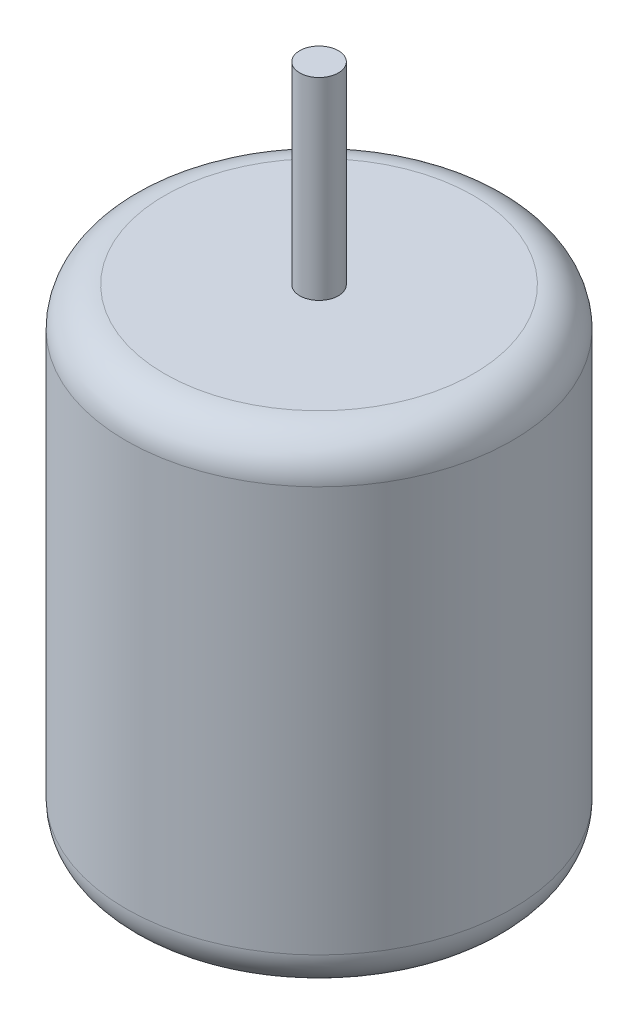
ISO-10303-21;
HEADER;
FILE_DESCRIPTION(('STEP AP214'),'2;1');
FILE_NAME('part.step','',(''),(''),'','','');
FILE_SCHEMA(('AUTOMOTIVE_DESIGN { 1 0 10303 214 1 1 1 1 }'));
ENDSEC;
DATA;
#1=APPLICATION_CONTEXT('core data for automotive mechanical design processes');
#2=APPLICATION_PROTOCOL_DEFINITION('international standard','automotive_design',2000,#1);
#3=PRODUCT_CONTEXT('',#1,'mechanical');
#4=PRODUCT('Part','Part','',(#3));
#5=PRODUCT_RELATED_PRODUCT_CATEGORY('part','',(#4));
#6=PRODUCT_DEFINITION_FORMATION('','',#4);
#7=PRODUCT_DEFINITION_CONTEXT('part definition',#1,'design');
#8=PRODUCT_DEFINITION('design','',#6,#7);
#9=PRODUCT_DEFINITION_SHAPE('','',#8);
#10=(LENGTH_UNIT() NAMED_UNIT(*) SI_UNIT(.MILLI.,.METRE.));
#11=(NAMED_UNIT(*) PLANE_ANGLE_UNIT() SI_UNIT($,.RADIAN.));
#12=(NAMED_UNIT(*) SI_UNIT($,.STERADIAN.) SOLID_ANGLE_UNIT());
#13=UNCERTAINTY_MEASURE_WITH_UNIT(LENGTH_MEASURE(1.E-05),#10,'distance_accuracy_value','');
#14=(GEOMETRIC_REPRESENTATION_CONTEXT(3) GLOBAL_UNCERTAINTY_ASSIGNED_CONTEXT((#13)) GLOBAL_UNIT_ASSIGNED_CONTEXT((#10,
#11,#12)) REPRESENTATION_CONTEXT('',''));
#15=CARTESIAN_POINT('',(0.,0.,0.));
#16=DIRECTION('',(0.,0.,1.));
#17=DIRECTION('',(1.,0.,0.));
#18=AXIS2_PLACEMENT_3D('',#15,#16,#17);
#19=CARTESIAN_POINT('',(0.,25.,0.));
#20=DIRECTION('',(0.,-1.,0.));
#21=DIRECTION('',(0.,0.,-1.));
#22=AXIS2_PLACEMENT_3D('',#19,#20,#21);
#23=CYLINDRICAL_SURFACE('',#22,10.);
#24=CARTESIAN_POINT('',(0.,2.,0.));
#25=DIRECTION('',(0.,1.,0.));
#26=DIRECTION('',(0.,0.,1.));
#27=AXIS2_PLACEMENT_3D('',#24,#25,#26);
#28=CIRCLE('',#27,10.);
#29=CARTESIAN_POINT('',(0.,2.,10.));
#30=VERTEX_POINT('',#29);
#31=EDGE_CURVE('E50',#30,#30,#28,.T.);
#32=ORIENTED_EDGE('',*,*,#31,.T.);
#33=EDGE_LOOP('',(#32));
#34=FACE_BOUND('',#33,.T.);
#35=CARTESIAN_POINT('',(0.,23.,0.));
#36=DIRECTION('',(0.,1.,0.));
#37=DIRECTION('',(0.,0.,1.));
#38=AXIS2_PLACEMENT_3D('',#35,#36,#37);
#39=CIRCLE('',#38,10.);
#40=CARTESIAN_POINT('',(0.,23.,10.));
#41=VERTEX_POINT('',#40);
#42=EDGE_CURVE('E55',#41,#41,#39,.F.);
#43=ORIENTED_EDGE('',*,*,#42,.T.);
#44=EDGE_LOOP('',(#43));
#45=FACE_BOUND('',#44,.T.);
#46=ADVANCED_FACE('F37',(#34,#45),#23,.T.);
#47=CARTESIAN_POINT('',(0.,25.,0.));
#48=DIRECTION('',(0.,1.,0.));
#49=DIRECTION('',(0.,0.,1.));
#50=AXIS2_PLACEMENT_3D('',#47,#48,#49);
#51=PLANE('',#50);
#52=CARTESIAN_POINT('',(0.,25.,0.));
#53=DIRECTION('',(0.,1.,0.));
#54=DIRECTION('',(0.,0.,1.));
#55=AXIS2_PLACEMENT_3D('',#52,#53,#54);
#56=CIRCLE('',#55,8.);
#57=CARTESIAN_POINT('',(0.,25.,8.));
#58=VERTEX_POINT('',#57);
#59=EDGE_CURVE('E10',#58,#58,#56,.T.);
#60=ORIENTED_EDGE('',*,*,#59,.T.);
#61=EDGE_LOOP('',(#60));
#62=FACE_BOUND('',#61,.T.);
#63=CARTESIAN_POINT('',(0.,25.,0.));
#64=DIRECTION('',(0.,1.,0.));
#65=DIRECTION('',(0.,0.,1.));
#66=AXIS2_PLACEMENT_3D('',#63,#64,#65);
#67=CIRCLE('',#66,1.);
#68=CARTESIAN_POINT('',(0.,25.,1.));
#69=VERTEX_POINT('',#68);
#70=EDGE_CURVE('E62',#69,#69,#67,.T.);
#71=ORIENTED_EDGE('',*,*,#70,.F.);
#72=EDGE_LOOP('',(#71));
#73=FACE_BOUND('',#72,.T.);
#74=ADVANCED_FACE('F79',(#62,#73),#51,.T.);
#75=CARTESIAN_POINT('',(0.,0.,0.));
#76=DIRECTION('',(0.,1.,0.));
#77=DIRECTION('',(0.,0.,1.));
#78=AXIS2_PLACEMENT_3D('',#75,#76,#77);
#79=PLANE('',#78);
#80=CARTESIAN_POINT('',(0.,0.,0.));
#81=DIRECTION('',(0.,1.,0.));
#82=DIRECTION('',(0.,0.,1.));
#83=AXIS2_PLACEMENT_3D('',#80,#81,#82);
#84=CIRCLE('',#83,8.);
#85=CARTESIAN_POINT('',(0.,0.,8.));
#86=VERTEX_POINT('',#85);
#87=EDGE_CURVE('E45',#86,#86,#84,.F.);
#88=ORIENTED_EDGE('',*,*,#87,.T.);
#89=EDGE_LOOP('',(#88));
#90=FACE_BOUND('',#89,.T.);
#91=ADVANCED_FACE('F75',(#90),#79,.F.);
#92=CARTESIAN_POINT('',(0.,35.,0.));
#93=DIRECTION('',(0.,-1.,0.));
#94=DIRECTION('',(0.,0.,-1.));
#95=AXIS2_PLACEMENT_3D('',#92,#93,#94);
#96=CYLINDRICAL_SURFACE('',#95,1.);
#97=CARTESIAN_POINT('',(0.,35.,0.));
#98=DIRECTION('',(0.,1.,0.));
#99=DIRECTION('',(0.,0.,1.));
#100=AXIS2_PLACEMENT_3D('',#97,#98,#99);
#101=CIRCLE('',#100,1.);
#102=CARTESIAN_POINT('',(0.,35.,1.));
#103=VERTEX_POINT('',#102);
#104=EDGE_CURVE('E61',#103,#103,#101,.T.);
#105=ORIENTED_EDGE('',*,*,#104,.F.);
#106=EDGE_LOOP('',(#105));
#107=FACE_BOUND('',#106,.T.);
#108=ORIENTED_EDGE('',*,*,#70,.T.);
#109=EDGE_LOOP('',(#108));
#110=FACE_BOUND('',#109,.T.);
#111=ADVANCED_FACE('F72',(#107,#110),#96,.T.);
#112=CARTESIAN_POINT('',(0.,35.,0.));
#113=DIRECTION('',(0.,1.,0.));
#114=DIRECTION('',(0.,0.,1.));
#115=AXIS2_PLACEMENT_3D('',#112,#113,#114);
#116=PLANE('',#115);
#117=ORIENTED_EDGE('',*,*,#104,.T.);
#118=EDGE_LOOP('',(#117));
#119=FACE_BOUND('',#118,.T.);
#120=ADVANCED_FACE('F70',(#119),#116,.T.);
#121=CARTESIAN_POINT('',(0.,2.,0.));
#122=DIRECTION('',(0.,1.,0.));
#123=DIRECTION('',(0.,0.,1.));
#124=AXIS2_PLACEMENT_3D('',#121,#122,#123);
#125=TOROIDAL_SURFACE('',#124,8.,2.);
#126=ORIENTED_EDGE('',*,*,#87,.F.);
#127=EDGE_LOOP('',(#126));
#128=FACE_BOUND('',#127,.T.);
#129=ORIENTED_EDGE('',*,*,#31,.F.);
#130=EDGE_LOOP('',(#129));
#131=FACE_BOUND('',#130,.T.);
#132=ADVANCED_FACE('F90',(#128,#131),#125,.T.);
#133=CARTESIAN_POINT('',(0.,23.,0.));
#134=DIRECTION('',(0.,1.,0.));
#135=DIRECTION('',(0.,0.,1.));
#136=AXIS2_PLACEMENT_3D('',#133,#134,#135);
#137=TOROIDAL_SURFACE('',#136,8.,2.);
#138=ORIENTED_EDGE('',*,*,#42,.F.);
#139=EDGE_LOOP('',(#138));
#140=FACE_BOUND('',#139,.T.);
#141=ORIENTED_EDGE('',*,*,#59,.F.);
#142=EDGE_LOOP('',(#141));
#143=FACE_BOUND('',#142,.T.);
#144=ADVANCED_FACE('F39',(#140,#143),#137,.T.);
#145=CLOSED_SHELL('',(#46,#74,#91,#111,#120,#132,#144));
#146=MANIFOLD_SOLID_BREP('B2',#145);
#147=ADVANCED_BREP_SHAPE_REPRESENTATION('',(#18,#146),#14);
#148=SHAPE_DEFINITION_REPRESENTATION(#9,#147);
ENDSEC;
END-ISO-10303-21;
